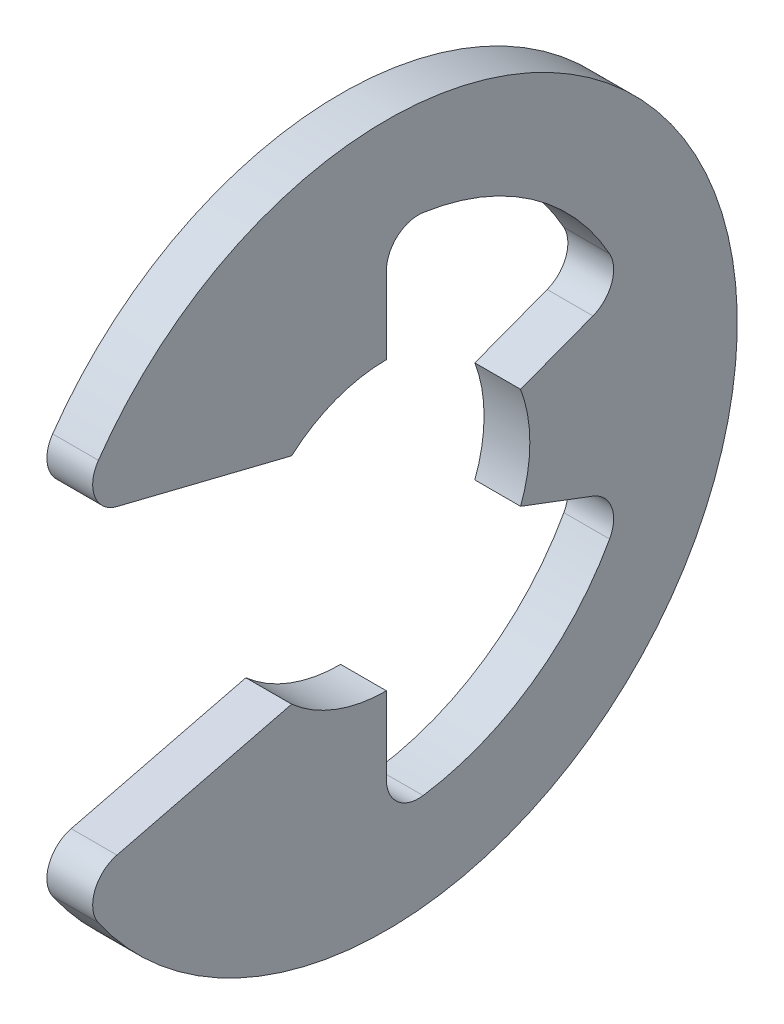
ISO-10303-21;
HEADER;
FILE_DESCRIPTION(('STEP AP214'),'2;1');
FILE_NAME('part.step','',(''),(''),'','','');
FILE_SCHEMA(('AUTOMOTIVE_DESIGN { 1 0 10303 214 1 1 1 1 }'));
ENDSEC;
DATA;
#1=APPLICATION_CONTEXT('core data for automotive mechanical design processes');
#2=APPLICATION_PROTOCOL_DEFINITION('international standard','automotive_design',2000,#1);
#3=PRODUCT_CONTEXT('',#1,'mechanical');
#4=PRODUCT('Part','Part','',(#3));
#5=PRODUCT_RELATED_PRODUCT_CATEGORY('part','',(#4));
#6=PRODUCT_DEFINITION_FORMATION('','',#4);
#7=PRODUCT_DEFINITION_CONTEXT('part definition',#1,'design');
#8=PRODUCT_DEFINITION('design','',#6,#7);
#9=PRODUCT_DEFINITION_SHAPE('','',#8);
#10=(LENGTH_UNIT() NAMED_UNIT(*) SI_UNIT(.MILLI.,.METRE.));
#11=(NAMED_UNIT(*) PLANE_ANGLE_UNIT() SI_UNIT($,.RADIAN.));
#12=(NAMED_UNIT(*) SI_UNIT($,.STERADIAN.) SOLID_ANGLE_UNIT());
#13=UNCERTAINTY_MEASURE_WITH_UNIT(LENGTH_MEASURE(1.E-05),#10,'distance_accuracy_value','');
#14=(GEOMETRIC_REPRESENTATION_CONTEXT(3) GLOBAL_UNCERTAINTY_ASSIGNED_CONTEXT((#13)) GLOBAL_UNIT_ASSIGNED_CONTEXT((#10,
#11,#12)) REPRESENTATION_CONTEXT('',''));
#15=CARTESIAN_POINT('',(0.,0.,0.));
#16=DIRECTION('',(0.,0.,1.));
#17=DIRECTION('',(1.,0.,0.));
#18=AXIS2_PLACEMENT_3D('',#15,#16,#17);
#19=CARTESIAN_POINT('',(0.1905,0.,0.));
#20=DIRECTION('',(-1.,0.,0.));
#21=DIRECTION('',(0.,0.,1.));
#22=AXIS2_PLACEMENT_3D('',#19,#20,#21);
#23=CYLINDRICAL_SURFACE('',#22,2.921);
#24=CARTESIAN_POINT('',(0.1905,0.,0.));
#25=DIRECTION('',(1.,0.,0.));
#26=DIRECTION('',(0.,0.,-1.));
#27=AXIS2_PLACEMENT_3D('',#24,#25,#26);
#28=CIRCLE('',#27,2.921);
#29=CARTESIAN_POINT('',(0.1905,-1.66741220680245,2.3983280702619));
#30=VERTEX_POINT('',#29);
#31=CARTESIAN_POINT('',(0.1905,1.66741220680245,2.3983280702619));
#32=VERTEX_POINT('',#31);
#33=EDGE_CURVE('E170',#30,#32,#28,.T.);
#34=ORIENTED_EDGE('',*,*,#33,.F.);
#35=DIRECTION('',(-1.,0.,0.));
#36=VECTOR('',#35,1.);
#37=CARTESIAN_POINT('',(0.1905,-1.66741220680245,2.3983280702619));
#38=LINE('',#37,#36);
#39=CARTESIAN_POINT('',(-0.1905,-1.66741220680245,2.3983280702619));
#40=VERTEX_POINT('',#39);
#41=EDGE_CURVE('E264',#30,#40,#38,.T.);
#42=ORIENTED_EDGE('',*,*,#41,.T.);
#43=CARTESIAN_POINT('',(-0.1905,0.,0.));
#44=DIRECTION('',(1.,0.,0.));
#45=DIRECTION('',(0.,0.,-1.));
#46=AXIS2_PLACEMENT_3D('',#43,#44,#45);
#47=CIRCLE('',#46,2.921);
#48=CARTESIAN_POINT('',(-0.1905,1.66741220680245,2.3983280702619));
#49=VERTEX_POINT('',#48);
#50=EDGE_CURVE('E208',#40,#49,#47,.T.);
#51=ORIENTED_EDGE('',*,*,#50,.T.);
#52=DIRECTION('',(-1.,0.,0.));
#53=VECTOR('',#52,1.);
#54=CARTESIAN_POINT('',(0.1905,1.66741220680245,2.3983280702619));
#55=LINE('',#54,#53);
#56=EDGE_CURVE('E262',#49,#32,#55,.F.);
#57=ORIENTED_EDGE('',*,*,#56,.T.);
#58=EDGE_LOOP('',(#34,#42,#51,#57));
#59=FACE_BOUND('',#58,.T.);
#60=ADVANCED_FACE('F32',(#59),#23,.T.);
#61=CARTESIAN_POINT('',(0.1905,1.34327136462124,2.59381245293267));
#62=DIRECTION('',(0.,0.970536829925373,-0.240952820606873));
#63=DIRECTION('',(0.,0.240952820606873,0.970536829925373));
#64=AXIS2_PLACEMENT_3D('',#61,#62,#63);
#65=PLANE('',#64);
#66=DIRECTION('',(0.,-0.240952820606873,-0.970536829925373));
#67=VECTOR('',#66,1.);
#68=CARTESIAN_POINT('',(0.1905,1.34327136462124,2.59381245293267));
#69=LINE('',#68,#67);
#70=CARTESIAN_POINT('',(0.1905,1.256328050162,2.24361240718949));
#71=VERTEX_POINT('',#70);
#72=CARTESIAN_POINT('',(0.1905,0.89535,0.789624478787227));
#73=VERTEX_POINT('',#72);
#74=EDGE_CURVE('E156',#71,#73,#69,.T.);
#75=ORIENTED_EDGE('',*,*,#74,.F.);
#76=DIRECTION('',(-1.,0.,0.));
#77=VECTOR('',#76,1.);
#78=CARTESIAN_POINT('',(0.1905,1.256328050162,2.24361240718949));
#79=LINE('',#78,#77);
#80=CARTESIAN_POINT('',(-0.1905,1.256328050162,2.24361240718949));
#81=VERTEX_POINT('',#80);
#82=EDGE_CURVE('E276',#71,#81,#79,.T.);
#83=ORIENTED_EDGE('',*,*,#82,.T.);
#84=DIRECTION('',(0.,-0.240952820606873,-0.970536829925373));
#85=VECTOR('',#84,1.);
#86=CARTESIAN_POINT('',(-0.1905,1.34327136462124,2.59381245293267));
#87=LINE('',#86,#85);
#88=CARTESIAN_POINT('',(-0.1905,0.89535,0.789624478787227));
#89=VERTEX_POINT('',#88);
#90=EDGE_CURVE('E176',#81,#89,#87,.T.);
#91=ORIENTED_EDGE('',*,*,#90,.T.);
#92=DIRECTION('',(-1.,0.,0.));
#93=VECTOR('',#92,1.);
#94=CARTESIAN_POINT('',(0.1905,0.89535,0.789624478787227));
#95=LINE('',#94,#93);
#96=EDGE_CURVE('E173',#73,#89,#95,.T.);
#97=ORIENTED_EDGE('',*,*,#96,.F.);
#98=EDGE_LOOP('',(#75,#83,#91,#97));
#99=FACE_BOUND('',#98,.T.);
#100=ADVANCED_FACE('F174',(#99),#65,.F.);
#101=CARTESIAN_POINT('',(0.1905,0.,0.));
#102=DIRECTION('',(-1.,0.,0.));
#103=DIRECTION('',(0.,0.,1.));
#104=AXIS2_PLACEMENT_3D('',#101,#102,#103);
#105=CYLINDRICAL_SURFACE('',#104,1.1938);
#106=CARTESIAN_POINT('',(-0.1905,0.,0.));
#107=DIRECTION('',(-1.,0.,0.));
#108=DIRECTION('',(0.,0.,1.));
#109=AXIS2_PLACEMENT_3D('',#106,#107,#108);
#110=CIRCLE('',#109,1.1938);
#111=CARTESIAN_POINT('',(-0.1905,1.1938,0.));
#112=VERTEX_POINT('',#111);
#113=EDGE_CURVE('E212',#89,#112,#110,.T.);
#114=ORIENTED_EDGE('',*,*,#113,.T.);
#115=DIRECTION('',(-1.,0.,0.));
#116=VECTOR('',#115,1.);
#117=CARTESIAN_POINT('',(0.1905,1.1938,0.));
#118=LINE('',#117,#116);
#119=CARTESIAN_POINT('',(0.1905,1.1938,0.));
#120=VERTEX_POINT('',#119);
#121=EDGE_CURVE('E180',#120,#112,#118,.T.);
#122=ORIENTED_EDGE('',*,*,#121,.F.);
#123=CARTESIAN_POINT('',(0.1905,0.,0.));
#124=DIRECTION('',(-1.,0.,0.));
#125=DIRECTION('',(0.,0.,1.));
#126=AXIS2_PLACEMENT_3D('',#123,#124,#125);
#127=CIRCLE('',#126,1.1938);
#128=EDGE_CURVE('E162',#73,#120,#127,.T.);
#129=ORIENTED_EDGE('',*,*,#128,.F.);
#130=ORIENTED_EDGE('',*,*,#96,.T.);
#131=EDGE_LOOP('',(#114,#122,#129,#130));
#132=FACE_BOUND('',#131,.T.);
#133=ADVANCED_FACE('F182',(#132),#105,.F.);
#134=CARTESIAN_POINT('',(0.1905,1.1938,0.));
#135=DIRECTION('',(0.,0.,1.));
#136=DIRECTION('',(0.,-1.,0.));
#137=AXIS2_PLACEMENT_3D('',#134,#135,#136);
#138=PLANE('',#137);
#139=DIRECTION('',(0.,1.,0.));
#140=VECTOR('',#139,1.);
#141=CARTESIAN_POINT('',(-0.1905,1.1938,0.));
#142=LINE('',#141,#140);
#143=CARTESIAN_POINT('',(-0.1905,1.83781710410404,0.));
#144=VERTEX_POINT('',#143);
#145=EDGE_CURVE('E214',#112,#144,#142,.T.);
#146=ORIENTED_EDGE('',*,*,#145,.T.);
#147=DIRECTION('',(1.,0.,0.));
#148=VECTOR('',#147,1.);
#149=CARTESIAN_POINT('',(0.1905,1.83781710410404,0.));
#150=LINE('',#149,#148);
#151=CARTESIAN_POINT('',(0.1905,1.83781710410404,0.));
#152=VERTEX_POINT('',#151);
#153=EDGE_CURVE('E260',#144,#152,#150,.T.);
#154=ORIENTED_EDGE('',*,*,#153,.T.);
#155=DIRECTION('',(0.,1.,0.));
#156=VECTOR('',#155,1.);
#157=CARTESIAN_POINT('',(0.1905,1.1938,0.));
#158=LINE('',#157,#156);
#159=EDGE_CURVE('E185',#120,#152,#158,.T.);
#160=ORIENTED_EDGE('',*,*,#159,.F.);
#161=ORIENTED_EDGE('',*,*,#121,.T.);
#162=EDGE_LOOP('',(#146,#154,#160,#161));
#163=FACE_BOUND('',#162,.T.);
#164=ADVANCED_FACE('F382',(#163),#138,.F.);
#165=CARTESIAN_POINT('',(0.1905,0.,0.));
#166=DIRECTION('',(-1.,0.,0.));
#167=DIRECTION('',(0.,0.,1.));
#168=AXIS2_PLACEMENT_3D('',#165,#166,#167);
#169=CYLINDRICAL_SURFACE('',#168,2.12376774193548);
#170=CARTESIAN_POINT('',(0.1905,0.,0.));
#171=DIRECTION('',(-1.,0.,0.));
#172=DIRECTION('',(0.,0.,-1.));
#173=AXIS2_PLACEMENT_3D('',#170,#171,#172);
#174=CIRCLE('',#173,2.12376774193548);
#175=CARTESIAN_POINT('',(0.1905,2.10175245260872,-0.305001720714758));
#176=VERTEX_POINT('',#175);
#177=CARTESIAN_POINT('',(0.1905,1.02838469113033,-1.85817500487293));
#178=VERTEX_POINT('',#177);
#179=EDGE_CURVE('E187',#176,#178,#174,.T.);
#180=ORIENTED_EDGE('',*,*,#179,.F.);
#181=DIRECTION('',(-1.,0.,0.));
#182=VECTOR('',#181,1.);
#183=CARTESIAN_POINT('',(0.1905,2.10175245260872,-0.305001720714758));
#184=LINE('',#183,#182);
#185=CARTESIAN_POINT('',(-0.1905,2.10175245260872,-0.305001720714758));
#186=VERTEX_POINT('',#185);
#187=EDGE_CURVE('E257',#176,#186,#184,.T.);
#188=ORIENTED_EDGE('',*,*,#187,.T.);
#189=CARTESIAN_POINT('',(-0.1905,0.,0.));
#190=DIRECTION('',(-1.,0.,0.));
#191=DIRECTION('',(0.,0.,-1.));
#192=AXIS2_PLACEMENT_3D('',#189,#190,#191);
#193=CIRCLE('',#192,2.12376774193548);
#194=CARTESIAN_POINT('',(-0.1905,1.02838469113033,-1.85817500487293));
#195=VERTEX_POINT('',#194);
#196=EDGE_CURVE('E217',#186,#195,#193,.T.);
#197=ORIENTED_EDGE('',*,*,#196,.T.);
#198=DIRECTION('',(-1.,0.,0.));
#199=VECTOR('',#198,1.);
#200=CARTESIAN_POINT('',(0.1905,1.02838469113033,-1.85817500487293));
#201=LINE('',#200,#199);
#202=EDGE_CURVE('E255',#195,#178,#201,.F.);
#203=ORIENTED_EDGE('',*,*,#202,.T.);
#204=EDGE_LOOP('',(#180,#188,#197,#203));
#205=FACE_BOUND('',#204,.T.);
#206=ADVANCED_FACE('F304',(#205),#169,.F.);
#207=CARTESIAN_POINT('',(0.1905,0.42207203769025,-1.11669764708268));
#208=DIRECTION('',(0.,-0.935414346693485,-0.353553390593274));
#209=DIRECTION('',(0.,0.353553390593274,-0.935414346693485));
#210=AXIS2_PLACEMENT_3D('',#207,#208,#209);
#211=PLANE('',#210);
#212=DIRECTION('',(0.,-0.353553390593274,0.935414346693485));
#213=VECTOR('',#212,1.);
#214=CARTESIAN_POINT('',(0.1905,0.42207203769025,-1.11669764708268));
#215=LINE('',#214,#213);
#216=CARTESIAN_POINT('',(0.1905,0.649766468446294,-1.71912048577759));
#217=VERTEX_POINT('',#216);
#218=CARTESIAN_POINT('',(0.1905,0.42207203769025,-1.11669764708268));
#219=VERTEX_POINT('',#218);
#220=EDGE_CURVE('E192',#217,#219,#215,.T.);
#221=ORIENTED_EDGE('',*,*,#220,.F.);
#222=DIRECTION('',(1.,0.,0.));
#223=VECTOR('',#222,1.);
#224=CARTESIAN_POINT('',(-0.1905,0.649766468446294,-1.71912048577759));
#225=LINE('',#224,#223);
#226=CARTESIAN_POINT('',(-0.1905,0.649766468446294,-1.71912048577759));
#227=VERTEX_POINT('',#226);
#228=EDGE_CURVE('E279',#217,#227,#225,.F.);
#229=ORIENTED_EDGE('',*,*,#228,.T.);
#230=DIRECTION('',(0.,-0.353553390593274,0.935414346693485));
#231=VECTOR('',#230,1.);
#232=CARTESIAN_POINT('',(-0.1905,0.42207203769025,-1.11669764708268));
#233=LINE('',#232,#231);
#234=CARTESIAN_POINT('',(-0.1905,0.42207203769025,-1.11669764708268));
#235=VERTEX_POINT('',#234);
#236=EDGE_CURVE('E220',#227,#235,#233,.T.);
#237=ORIENTED_EDGE('',*,*,#236,.T.);
#238=DIRECTION('',(-1.,0.,0.));
#239=VECTOR('',#238,1.);
#240=CARTESIAN_POINT('',(0.1905,0.42207203769025,-1.11669764708268));
#241=LINE('',#240,#239);
#242=EDGE_CURVE('E244',#219,#235,#241,.T.);
#243=ORIENTED_EDGE('',*,*,#242,.F.);
#244=EDGE_LOOP('',(#221,#229,#237,#243));
#245=FACE_BOUND('',#244,.T.);
#246=ADVANCED_FACE('F307',(#245),#211,.F.);
#247=CARTESIAN_POINT('',(0.1905,0.,0.));
#248=DIRECTION('',(-1.,0.,0.));
#249=DIRECTION('',(0.,0.,1.));
#250=AXIS2_PLACEMENT_3D('',#247,#248,#249);
#251=CYLINDRICAL_SURFACE('',#250,1.1938);
#252=CARTESIAN_POINT('',(-0.1905,0.,0.));
#253=DIRECTION('',(-1.,0.,0.));
#254=DIRECTION('',(0.,0.,1.));
#255=AXIS2_PLACEMENT_3D('',#252,#253,#254);
#256=CIRCLE('',#255,1.1938);
#257=CARTESIAN_POINT('',(-0.1905,-0.42207203769025,-1.11669764708268));
#258=VERTEX_POINT('',#257);
#259=EDGE_CURVE('E222',#235,#258,#256,.T.);
#260=ORIENTED_EDGE('',*,*,#259,.T.);
#261=DIRECTION('',(-1.,0.,0.));
#262=VECTOR('',#261,1.);
#263=CARTESIAN_POINT('',(0.1905,-0.42207203769025,-1.11669764708268));
#264=LINE('',#263,#262);
#265=CARTESIAN_POINT('',(0.1905,-0.42207203769025,-1.11669764708268));
#266=VERTEX_POINT('',#265);
#267=EDGE_CURVE('E241',#266,#258,#264,.T.);
#268=ORIENTED_EDGE('',*,*,#267,.F.);
#269=CARTESIAN_POINT('',(0.1905,0.,0.));
#270=DIRECTION('',(-1.,0.,0.));
#271=DIRECTION('',(0.,0.,1.));
#272=AXIS2_PLACEMENT_3D('',#269,#270,#271);
#273=CIRCLE('',#272,1.1938);
#274=EDGE_CURVE('E194',#219,#266,#273,.T.);
#275=ORIENTED_EDGE('',*,*,#274,.F.);
#276=ORIENTED_EDGE('',*,*,#242,.T.);
#277=EDGE_LOOP('',(#260,#268,#275,#276));
#278=FACE_BOUND('',#277,.T.);
#279=ADVANCED_FACE('F313',(#278),#251,.F.);
#280=CARTESIAN_POINT('',(0.1905,-0.42207203769025,-1.11669764708268));
#281=DIRECTION('',(0.,0.935414346693485,-0.353553390593273));
#282=DIRECTION('',(0.,0.353553390593273,0.935414346693485));
#283=AXIS2_PLACEMENT_3D('',#280,#281,#282);
#284=PLANE('',#283);
#285=DIRECTION('',(0.,-0.353553390593273,-0.935414346693485));
#286=VECTOR('',#285,1.);
#287=CARTESIAN_POINT('',(-0.1905,-0.42207203769025,-1.11669764708268));
#288=LINE('',#287,#286);
#289=CARTESIAN_POINT('',(-0.1905,-0.649766468446294,-1.71912048577759));
#290=VERTEX_POINT('',#289);
#291=EDGE_CURVE('E224',#258,#290,#288,.T.);
#292=ORIENTED_EDGE('',*,*,#291,.T.);
#293=DIRECTION('',(1.,0.,0.));
#294=VECTOR('',#293,1.);
#295=CARTESIAN_POINT('',(0.1905,-0.649766468446294,-1.71912048577759));
#296=LINE('',#295,#294);
#297=CARTESIAN_POINT('',(0.1905,-0.649766468446294,-1.71912048577759));
#298=VERTEX_POINT('',#297);
#299=EDGE_CURVE('E47',#290,#298,#296,.T.);
#300=ORIENTED_EDGE('',*,*,#299,.T.);
#301=DIRECTION('',(0.,-0.353553390593273,-0.935414346693485));
#302=VECTOR('',#301,1.);
#303=CARTESIAN_POINT('',(0.1905,-0.42207203769025,-1.11669764708268));
#304=LINE('',#303,#302);
#305=EDGE_CURVE('E196',#266,#298,#304,.T.);
#306=ORIENTED_EDGE('',*,*,#305,.F.);
#307=ORIENTED_EDGE('',*,*,#267,.T.);
#308=EDGE_LOOP('',(#292,#300,#306,#307));
#309=FACE_BOUND('',#308,.T.);
#310=ADVANCED_FACE('F315',(#309),#284,.F.);
#311=CARTESIAN_POINT('',(0.1905,0.,0.));
#312=DIRECTION('',(-1.,0.,0.));
#313=DIRECTION('',(0.,0.,1.));
#314=AXIS2_PLACEMENT_3D('',#311,#312,#313);
#315=CYLINDRICAL_SURFACE('',#314,2.12376774193548);
#316=CARTESIAN_POINT('',(-0.1905,0.,0.));
#317=DIRECTION('',(-1.,0.,0.));
#318=DIRECTION('',(0.,0.,-1.));
#319=AXIS2_PLACEMENT_3D('',#316,#317,#318);
#320=CIRCLE('',#319,2.12376774193548);
#321=CARTESIAN_POINT('',(-0.1905,-1.02838469113033,-1.85817500487293));
#322=VERTEX_POINT('',#321);
#323=CARTESIAN_POINT('',(-0.1905,-2.10175245260872,-0.305001720714758));
#324=VERTEX_POINT('',#323);
#325=EDGE_CURVE('E226',#322,#324,#320,.T.);
#326=ORIENTED_EDGE('',*,*,#325,.T.);
#327=DIRECTION('',(-1.,0.,0.));
#328=VECTOR('',#327,1.);
#329=CARTESIAN_POINT('',(0.1905,-2.10175245260872,-0.305001720714758));
#330=LINE('',#329,#328);
#331=CARTESIAN_POINT('',(0.1905,-2.10175245260872,-0.305001720714758));
#332=VERTEX_POINT('',#331);
#333=EDGE_CURVE('E253',#324,#332,#330,.F.);
#334=ORIENTED_EDGE('',*,*,#333,.T.);
#335=CARTESIAN_POINT('',(0.1905,0.,0.));
#336=DIRECTION('',(-1.,0.,0.));
#337=DIRECTION('',(0.,0.,-1.));
#338=AXIS2_PLACEMENT_3D('',#335,#336,#337);
#339=CIRCLE('',#338,2.12376774193548);
#340=CARTESIAN_POINT('',(0.1905,-1.02838469113033,-1.85817500487293));
#341=VERTEX_POINT('',#340);
#342=EDGE_CURVE('E198',#341,#332,#339,.T.);
#343=ORIENTED_EDGE('',*,*,#342,.F.);
#344=DIRECTION('',(-1.,0.,0.));
#345=VECTOR('',#344,1.);
#346=CARTESIAN_POINT('',(0.1905,-1.02838469113033,-1.85817500487293));
#347=LINE('',#346,#345);
#348=EDGE_CURVE('E250',#341,#322,#347,.T.);
#349=ORIENTED_EDGE('',*,*,#348,.T.);
#350=EDGE_LOOP('',(#326,#334,#343,#349));
#351=FACE_BOUND('',#350,.T.);
#352=ADVANCED_FACE('F317',(#351),#315,.F.);
#353=CARTESIAN_POINT('',(0.1905,-1.1938,0.));
#354=DIRECTION('',(0.,0.,1.));
#355=DIRECTION('',(0.,-1.,0.));
#356=AXIS2_PLACEMENT_3D('',#353,#354,#355);
#357=PLANE('',#356);
#358=DIRECTION('',(0.,1.,0.));
#359=VECTOR('',#358,1.);
#360=CARTESIAN_POINT('',(0.1905,-1.1938,0.));
#361=LINE('',#360,#359);
#362=CARTESIAN_POINT('',(0.1905,-1.83781710410404,0.));
#363=VERTEX_POINT('',#362);
#364=CARTESIAN_POINT('',(0.1905,-1.1938,0.));
#365=VERTEX_POINT('',#364);
#366=EDGE_CURVE('E201',#363,#365,#361,.T.);
#367=ORIENTED_EDGE('',*,*,#366,.F.);
#368=DIRECTION('',(1.,0.,0.));
#369=VECTOR('',#368,1.);
#370=CARTESIAN_POINT('',(-0.1905,-1.83781710410404,0.));
#371=LINE('',#370,#369);
#372=CARTESIAN_POINT('',(-0.1905,-1.83781710410404,0.));
#373=VERTEX_POINT('',#372);
#374=EDGE_CURVE('E179',#363,#373,#371,.F.);
#375=ORIENTED_EDGE('',*,*,#374,.T.);
#376=DIRECTION('',(0.,1.,0.));
#377=VECTOR('',#376,1.);
#378=CARTESIAN_POINT('',(-0.1905,-1.1938,0.));
#379=LINE('',#378,#377);
#380=CARTESIAN_POINT('',(-0.1905,-1.1938,0.));
#381=VERTEX_POINT('',#380);
#382=EDGE_CURVE('E229',#373,#381,#379,.T.);
#383=ORIENTED_EDGE('',*,*,#382,.T.);
#384=DIRECTION('',(-1.,0.,0.));
#385=VECTOR('',#384,1.);
#386=CARTESIAN_POINT('',(0.1905,-1.1938,0.));
#387=LINE('',#386,#385);
#388=EDGE_CURVE('E238',#365,#381,#387,.T.);
#389=ORIENTED_EDGE('',*,*,#388,.F.);
#390=EDGE_LOOP('',(#367,#375,#383,#389));
#391=FACE_BOUND('',#390,.T.);
#392=ADVANCED_FACE('F323',(#391),#357,.F.);
#393=CARTESIAN_POINT('',(0.1905,0.,0.));
#394=DIRECTION('',(-1.,0.,0.));
#395=DIRECTION('',(0.,0.,1.));
#396=AXIS2_PLACEMENT_3D('',#393,#394,#395);
#397=CYLINDRICAL_SURFACE('',#396,1.1938);
#398=CARTESIAN_POINT('',(-0.1905,0.,0.));
#399=DIRECTION('',(-1.,0.,0.));
#400=DIRECTION('',(0.,0.,-1.));
#401=AXIS2_PLACEMENT_3D('',#398,#399,#400);
#402=CIRCLE('',#401,1.1938);
#403=CARTESIAN_POINT('',(-0.1905,-0.89535,0.789624478787227));
#404=VERTEX_POINT('',#403);
#405=EDGE_CURVE('E231',#381,#404,#402,.T.);
#406=ORIENTED_EDGE('',*,*,#405,.T.);
#407=DIRECTION('',(-1.,0.,0.));
#408=VECTOR('',#407,1.);
#409=CARTESIAN_POINT('',(0.1905,-0.89535,0.789624478787227));
#410=LINE('',#409,#408);
#411=CARTESIAN_POINT('',(0.1905,-0.89535,0.789624478787227));
#412=VERTEX_POINT('',#411);
#413=EDGE_CURVE('E207',#412,#404,#410,.T.);
#414=ORIENTED_EDGE('',*,*,#413,.F.);
#415=CARTESIAN_POINT('',(0.1905,0.,0.));
#416=DIRECTION('',(-1.,0.,0.));
#417=DIRECTION('',(0.,0.,-1.));
#418=AXIS2_PLACEMENT_3D('',#415,#416,#417);
#419=CIRCLE('',#418,1.1938);
#420=EDGE_CURVE('E203',#365,#412,#419,.T.);
#421=ORIENTED_EDGE('',*,*,#420,.F.);
#422=ORIENTED_EDGE('',*,*,#388,.T.);
#423=EDGE_LOOP('',(#406,#414,#421,#422));
#424=FACE_BOUND('',#423,.T.);
#425=ADVANCED_FACE('F372',(#424),#397,.F.);
#426=CARTESIAN_POINT('',(0.1905,-1.34327136462124,2.59381245293267));
#427=DIRECTION('',(0.,-0.970536829925373,-0.240952820606873));
#428=DIRECTION('',(0.,0.240952820606873,-0.970536829925373));
#429=AXIS2_PLACEMENT_3D('',#426,#427,#428);
#430=PLANE('',#429);
#431=DIRECTION('',(0.,-0.240952820606873,0.970536829925373));
#432=VECTOR('',#431,1.);
#433=CARTESIAN_POINT('',(-0.1905,-1.34327136462124,2.59381245293267));
#434=LINE('',#433,#432);
#435=CARTESIAN_POINT('',(-0.1905,-1.256328050162,2.24361240718949));
#436=VERTEX_POINT('',#435);
#437=EDGE_CURVE('E233',#404,#436,#434,.T.);
#438=ORIENTED_EDGE('',*,*,#437,.T.);
#439=DIRECTION('',(-1.,0.,0.));
#440=VECTOR('',#439,1.);
#441=CARTESIAN_POINT('',(0.1905,-1.256328050162,2.24361240718949));
#442=LINE('',#441,#440);
#443=CARTESIAN_POINT('',(0.1905,-1.256328050162,2.24361240718949));
#444=VERTEX_POINT('',#443);
#445=EDGE_CURVE('E271',#436,#444,#442,.F.);
#446=ORIENTED_EDGE('',*,*,#445,.T.);
#447=DIRECTION('',(0.,-0.240952820606873,0.970536829925373));
#448=VECTOR('',#447,1.);
#449=CARTESIAN_POINT('',(0.1905,-1.34327136462124,2.59381245293267));
#450=LINE('',#449,#448);
#451=EDGE_CURVE('E205',#412,#444,#450,.T.);
#452=ORIENTED_EDGE('',*,*,#451,.F.);
#453=ORIENTED_EDGE('',*,*,#413,.T.);
#454=EDGE_LOOP('',(#438,#446,#452,#453));
#455=FACE_BOUND('',#454,.T.);
#456=ADVANCED_FACE('F414',(#455),#430,.F.);
#457=CARTESIAN_POINT('',(0.1905,0.,0.));
#458=DIRECTION('',(1.,0.,0.));
#459=DIRECTION('',(0.,0.,-1.));
#460=AXIS2_PLACEMENT_3D('',#457,#458,#459);
#461=PLANE('',#460);
#462=ORIENTED_EDGE('',*,*,#451,.T.);
#463=CARTESIAN_POINT('',(0.1905,-1.5151702227031,2.17935028993364));
#464=DIRECTION('',(1.,0.,0.));
#465=DIRECTION('',(0.,0.,-1.));
#466=AXIS2_PLACEMENT_3D('',#463,#464,#465);
#467=CIRCLE('',#466,0.2667);
#468=EDGE_CURVE('E274',#444,#30,#467,.T.);
#469=ORIENTED_EDGE('',*,*,#468,.T.);
#470=ORIENTED_EDGE('',*,*,#33,.T.);
#471=CARTESIAN_POINT('',(0.1905,1.5151702227031,2.17935028993364));
#472=DIRECTION('',(1.,0.,0.));
#473=DIRECTION('',(0.,0.,-1.));
#474=AXIS2_PLACEMENT_3D('',#471,#472,#473);
#475=CIRCLE('',#474,0.2667);
#476=EDGE_CURVE('E166',#32,#71,#475,.T.);
#477=ORIENTED_EDGE('',*,*,#476,.T.);
#478=ORIENTED_EDGE('',*,*,#74,.T.);
#479=ORIENTED_EDGE('',*,*,#128,.T.);
#480=ORIENTED_EDGE('',*,*,#159,.T.);
#481=CARTESIAN_POINT('',(0.1905,1.83781710410404,-0.266699999999999));
#482=DIRECTION('',(1.,0.,0.));
#483=DIRECTION('',(0.,0.,-1.));
#484=AXIS2_PLACEMENT_3D('',#481,#482,#483);
#485=CIRCLE('',#484,0.2667);
#486=EDGE_CURVE('E288',#152,#176,#485,.F.);
#487=ORIENTED_EDGE('',*,*,#486,.T.);
#488=ORIENTED_EDGE('',*,*,#179,.T.);
#489=CARTESIAN_POINT('',(0.1905,0.899241474709447,-1.62482779650637));
#490=DIRECTION('',(1.,0.,0.));
#491=DIRECTION('',(0.,0.,-1.));
#492=AXIS2_PLACEMENT_3D('',#489,#490,#491);
#493=CIRCLE('',#492,0.2667);
#494=EDGE_CURVE('E11',#178,#217,#493,.F.);
#495=ORIENTED_EDGE('',*,*,#494,.T.);
#496=ORIENTED_EDGE('',*,*,#220,.T.);
#497=ORIENTED_EDGE('',*,*,#274,.T.);
#498=ORIENTED_EDGE('',*,*,#305,.T.);
#499=CARTESIAN_POINT('',(0.1905,-0.899241474709446,-1.62482779650637));
#500=DIRECTION('',(1.,0.,0.));
#501=DIRECTION('',(0.,0.,-1.));
#502=AXIS2_PLACEMENT_3D('',#499,#500,#501);
#503=CIRCLE('',#502,0.2667);
#504=EDGE_CURVE('E292',#298,#341,#503,.F.);
#505=ORIENTED_EDGE('',*,*,#504,.T.);
#506=ORIENTED_EDGE('',*,*,#342,.T.);
#507=CARTESIAN_POINT('',(0.1905,-1.83781710410404,-0.2667));
#508=DIRECTION('',(1.,0.,0.));
#509=DIRECTION('',(0.,0.,-1.));
#510=AXIS2_PLACEMENT_3D('',#507,#508,#509);
#511=CIRCLE('',#510,0.2667);
#512=EDGE_CURVE('E284',#332,#363,#511,.F.);
#513=ORIENTED_EDGE('',*,*,#512,.T.);
#514=ORIENTED_EDGE('',*,*,#366,.T.);
#515=ORIENTED_EDGE('',*,*,#420,.T.);
#516=EDGE_LOOP('',(#462,#469,#470,#477,#478,#479,#480,#487,#488,#495,#496,#497,#498,#505,#506,
#513,#514,#515));
#517=FACE_BOUND('',#516,.T.);
#518=ADVANCED_FACE('F159',(#517),#461,.T.);
#519=CARTESIAN_POINT('',(-0.1905,0.,0.));
#520=DIRECTION('',(1.,0.,0.));
#521=DIRECTION('',(0.,0.,-1.));
#522=AXIS2_PLACEMENT_3D('',#519,#520,#521);
#523=PLANE('',#522);
#524=ORIENTED_EDGE('',*,*,#50,.F.);
#525=CARTESIAN_POINT('',(-0.1905,-1.5151702227031,2.17935028993364));
#526=DIRECTION('',(1.,0.,0.));
#527=DIRECTION('',(0.,0.,-1.));
#528=AXIS2_PLACEMENT_3D('',#525,#526,#527);
#529=CIRCLE('',#528,0.2667);
#530=EDGE_CURVE('E269',#40,#436,#529,.F.);
#531=ORIENTED_EDGE('',*,*,#530,.T.);
#532=ORIENTED_EDGE('',*,*,#437,.F.);
#533=ORIENTED_EDGE('',*,*,#405,.F.);
#534=ORIENTED_EDGE('',*,*,#382,.F.);
#535=CARTESIAN_POINT('',(-0.1905,-1.83781710410404,-0.2667));
#536=DIRECTION('',(1.,0.,0.));
#537=DIRECTION('',(0.,0.,-1.));
#538=AXIS2_PLACEMENT_3D('',#535,#536,#537);
#539=CIRCLE('',#538,0.2667);
#540=EDGE_CURVE('E282',#373,#324,#539,.T.);
#541=ORIENTED_EDGE('',*,*,#540,.T.);
#542=ORIENTED_EDGE('',*,*,#325,.F.);
#543=CARTESIAN_POINT('',(-0.1905,-0.899241474709446,-1.62482779650637));
#544=DIRECTION('',(1.,0.,0.));
#545=DIRECTION('',(0.,0.,-1.));
#546=AXIS2_PLACEMENT_3D('',#543,#544,#545);
#547=CIRCLE('',#546,0.2667);
#548=EDGE_CURVE('E290',#322,#290,#547,.T.);
#549=ORIENTED_EDGE('',*,*,#548,.T.);
#550=ORIENTED_EDGE('',*,*,#291,.F.);
#551=ORIENTED_EDGE('',*,*,#259,.F.);
#552=ORIENTED_EDGE('',*,*,#236,.F.);
#553=CARTESIAN_POINT('',(-0.1905,0.899241474709447,-1.62482779650637));
#554=DIRECTION('',(1.,0.,0.));
#555=DIRECTION('',(0.,0.,-1.));
#556=AXIS2_PLACEMENT_3D('',#553,#554,#555);
#557=CIRCLE('',#556,0.2667);
#558=EDGE_CURVE('E40',#227,#195,#557,.T.);
#559=ORIENTED_EDGE('',*,*,#558,.T.);
#560=ORIENTED_EDGE('',*,*,#196,.F.);
#561=CARTESIAN_POINT('',(-0.1905,1.83781710410404,-0.266699999999999));
#562=DIRECTION('',(1.,0.,0.));
#563=DIRECTION('',(0.,0.,-1.));
#564=AXIS2_PLACEMENT_3D('',#561,#562,#563);
#565=CIRCLE('',#564,0.2667);
#566=EDGE_CURVE('E286',#186,#144,#565,.T.);
#567=ORIENTED_EDGE('',*,*,#566,.T.);
#568=ORIENTED_EDGE('',*,*,#145,.F.);
#569=ORIENTED_EDGE('',*,*,#113,.F.);
#570=ORIENTED_EDGE('',*,*,#90,.F.);
#571=CARTESIAN_POINT('',(-0.1905,1.5151702227031,2.17935028993364));
#572=DIRECTION('',(1.,0.,0.));
#573=DIRECTION('',(0.,0.,-1.));
#574=AXIS2_PLACEMENT_3D('',#571,#572,#573);
#575=CIRCLE('',#574,0.2667);
#576=EDGE_CURVE('E267',#81,#49,#575,.F.);
#577=ORIENTED_EDGE('',*,*,#576,.T.);
#578=EDGE_LOOP('',(#524,#531,#532,#533,#534,#541,#542,#549,#550,#551,#552,#559,#560,#567,#568,
#569,#570,#577));
#579=FACE_BOUND('',#578,.T.);
#580=ADVANCED_FACE('F297',(#579),#523,.F.);
#581=CARTESIAN_POINT('',(0.1905,-1.83781710410404,-0.2667));
#582=DIRECTION('',(-1.,0.,0.));
#583=DIRECTION('',(0.,0.,1.));
#584=AXIS2_PLACEMENT_3D('',#581,#582,#583);
#585=CYLINDRICAL_SURFACE('',#584,0.2667);
#586=ORIENTED_EDGE('',*,*,#512,.F.);
#587=ORIENTED_EDGE('',*,*,#333,.F.);
#588=ORIENTED_EDGE('',*,*,#540,.F.);
#589=ORIENTED_EDGE('',*,*,#374,.F.);
#590=EDGE_LOOP('',(#586,#587,#588,#589));
#591=FACE_BOUND('',#590,.T.);
#592=ADVANCED_FACE('F337',(#591),#585,.F.);
#593=CARTESIAN_POINT('',(0.1905,1.83781710410404,-0.266699999999999));
#594=DIRECTION('',(-1.,0.,0.));
#595=DIRECTION('',(0.,0.,1.));
#596=AXIS2_PLACEMENT_3D('',#593,#594,#595);
#597=CYLINDRICAL_SURFACE('',#596,0.2667);
#598=ORIENTED_EDGE('',*,*,#486,.F.);
#599=ORIENTED_EDGE('',*,*,#153,.F.);
#600=ORIENTED_EDGE('',*,*,#566,.F.);
#601=ORIENTED_EDGE('',*,*,#187,.F.);
#602=EDGE_LOOP('',(#598,#599,#600,#601));
#603=FACE_BOUND('',#602,.T.);
#604=ADVANCED_FACE('F340',(#603),#597,.F.);
#605=CARTESIAN_POINT('',(0.1905,-1.5151702227031,2.17935028993364));
#606=DIRECTION('',(-1.,0.,0.));
#607=DIRECTION('',(0.,0.,1.));
#608=AXIS2_PLACEMENT_3D('',#605,#606,#607);
#609=CYLINDRICAL_SURFACE('',#608,0.2667);
#610=ORIENTED_EDGE('',*,*,#468,.F.);
#611=ORIENTED_EDGE('',*,*,#445,.F.);
#612=ORIENTED_EDGE('',*,*,#530,.F.);
#613=ORIENTED_EDGE('',*,*,#41,.F.);
#614=EDGE_LOOP('',(#610,#611,#612,#613));
#615=FACE_BOUND('',#614,.T.);
#616=ADVANCED_FACE('F344',(#615),#609,.T.);
#617=CARTESIAN_POINT('',(0.1905,1.5151702227031,2.17935028993364));
#618=DIRECTION('',(-1.,0.,0.));
#619=DIRECTION('',(0.,0.,1.));
#620=AXIS2_PLACEMENT_3D('',#617,#618,#619);
#621=CYLINDRICAL_SURFACE('',#620,0.2667);
#622=ORIENTED_EDGE('',*,*,#476,.F.);
#623=ORIENTED_EDGE('',*,*,#56,.F.);
#624=ORIENTED_EDGE('',*,*,#576,.F.);
#625=ORIENTED_EDGE('',*,*,#82,.F.);
#626=EDGE_LOOP('',(#622,#623,#624,#625));
#627=FACE_BOUND('',#626,.T.);
#628=ADVANCED_FACE('F348',(#627),#621,.T.);
#629=CARTESIAN_POINT('',(0.1905,-0.899241474709446,-1.62482779650637));
#630=DIRECTION('',(-1.,0.,0.));
#631=DIRECTION('',(0.,0.,1.));
#632=AXIS2_PLACEMENT_3D('',#629,#630,#631);
#633=CYLINDRICAL_SURFACE('',#632,0.2667);
#634=ORIENTED_EDGE('',*,*,#504,.F.);
#635=ORIENTED_EDGE('',*,*,#299,.F.);
#636=ORIENTED_EDGE('',*,*,#548,.F.);
#637=ORIENTED_EDGE('',*,*,#348,.F.);
#638=EDGE_LOOP('',(#634,#635,#636,#637));
#639=FACE_BOUND('',#638,.T.);
#640=ADVANCED_FACE('F351',(#639),#633,.F.);
#641=CARTESIAN_POINT('',(0.1905,0.899241474709447,-1.62482779650637));
#642=DIRECTION('',(-1.,0.,0.));
#643=DIRECTION('',(0.,0.,1.));
#644=AXIS2_PLACEMENT_3D('',#641,#642,#643);
#645=CYLINDRICAL_SURFACE('',#644,0.2667);
#646=ORIENTED_EDGE('',*,*,#494,.F.);
#647=ORIENTED_EDGE('',*,*,#202,.F.);
#648=ORIENTED_EDGE('',*,*,#558,.F.);
#649=ORIENTED_EDGE('',*,*,#228,.F.);
#650=EDGE_LOOP('',(#646,#647,#648,#649));
#651=FACE_BOUND('',#650,.T.);
#652=ADVANCED_FACE('F34',(#651),#645,.F.);
#653=CLOSED_SHELL('',(#60,#100,#133,#164,#206,#246,#279,#310,#352,#392,#425,#456,#518,#580,#592,
#604,#616,#628,#640,#652));
#654=MANIFOLD_SOLID_BREP('B2',#653);
#655=ADVANCED_BREP_SHAPE_REPRESENTATION('',(#18,#654),#14);
#656=SHAPE_DEFINITION_REPRESENTATION(#9,#655);
ENDSEC;
END-ISO-10303-21;
